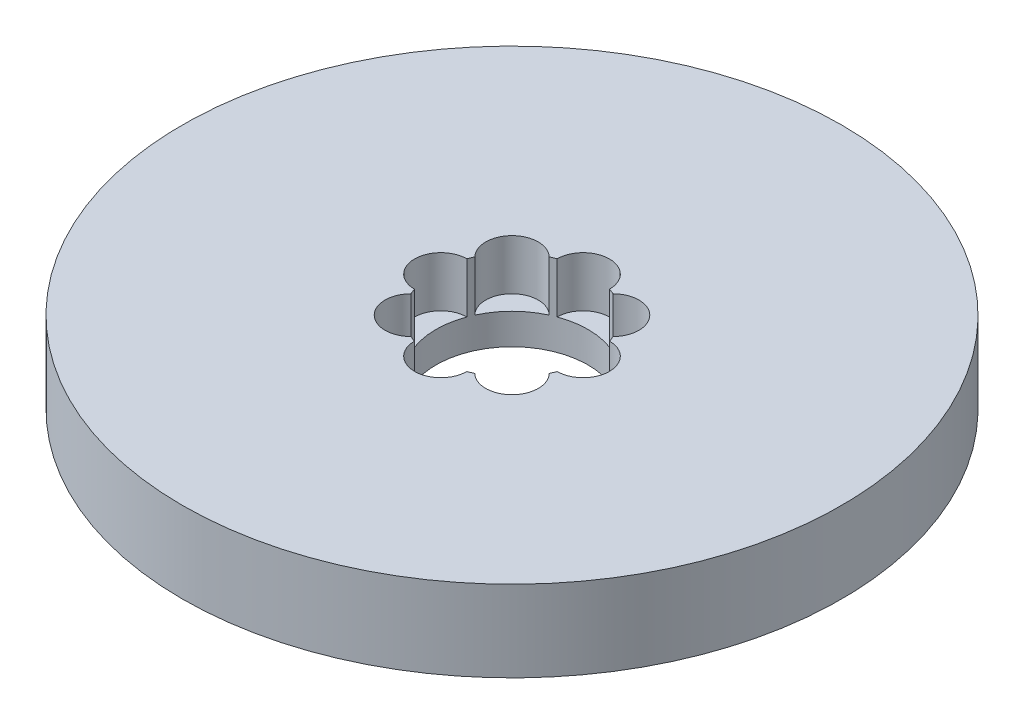
ISO-10303-21;
HEADER;
FILE_DESCRIPTION(('STEP AP214'),'2;1');
FILE_NAME('part.step','',(''),(''),'','','');
FILE_SCHEMA(('AUTOMOTIVE_DESIGN { 1 0 10303 214 1 1 1 1 }'));
ENDSEC;
DATA;
#1=APPLICATION_CONTEXT('core data for automotive mechanical design processes');
#2=APPLICATION_PROTOCOL_DEFINITION('international standard','automotive_design',2000,#1);
#3=PRODUCT_CONTEXT('',#1,'mechanical');
#4=PRODUCT('Part','Part','',(#3));
#5=PRODUCT_RELATED_PRODUCT_CATEGORY('part','',(#4));
#6=PRODUCT_DEFINITION_FORMATION('','',#4);
#7=PRODUCT_DEFINITION_CONTEXT('part definition',#1,'design');
#8=PRODUCT_DEFINITION('design','',#6,#7);
#9=PRODUCT_DEFINITION_SHAPE('','',#8);
#10=(LENGTH_UNIT() NAMED_UNIT(*) SI_UNIT(.MILLI.,.METRE.));
#11=(NAMED_UNIT(*) PLANE_ANGLE_UNIT() SI_UNIT($,.RADIAN.));
#12=(NAMED_UNIT(*) SI_UNIT($,.STERADIAN.) SOLID_ANGLE_UNIT());
#13=UNCERTAINTY_MEASURE_WITH_UNIT(LENGTH_MEASURE(1.E-05),#10,'distance_accuracy_value','');
#14=(GEOMETRIC_REPRESENTATION_CONTEXT(3) GLOBAL_UNCERTAINTY_ASSIGNED_CONTEXT((#13)) GLOBAL_UNIT_ASSIGNED_CONTEXT((#10,
#11,#12)) REPRESENTATION_CONTEXT('',''));
#15=CARTESIAN_POINT('',(0.,0.,0.));
#16=DIRECTION('',(0.,0.,1.));
#17=DIRECTION('',(1.,0.,0.));
#18=AXIS2_PLACEMENT_3D('',#15,#16,#17);
#19=CARTESIAN_POINT('',(0.,16.,0.));
#20=DIRECTION('',(0.,-1.,0.));
#21=DIRECTION('',(0.,0.,-1.));
#22=AXIS2_PLACEMENT_3D('',#19,#20,#21);
#23=CYLINDRICAL_SURFACE('',#22,65.);
#24=CARTESIAN_POINT('',(0.,16.,0.));
#25=DIRECTION('',(0.,1.,0.));
#26=DIRECTION('',(0.,0.,1.));
#27=AXIS2_PLACEMENT_3D('',#24,#25,#26);
#28=CIRCLE('',#27,65.);
#29=CARTESIAN_POINT('',(0.,16.,65.));
#30=VERTEX_POINT('',#29);
#31=EDGE_CURVE('E190',#30,#30,#28,.T.);
#32=ORIENTED_EDGE('',*,*,#31,.F.);
#33=EDGE_LOOP('',(#32));
#34=FACE_BOUND('',#33,.T.);
#35=CARTESIAN_POINT('',(0.,0.,0.));
#36=DIRECTION('',(0.,1.,0.));
#37=DIRECTION('',(0.,0.,1.));
#38=AXIS2_PLACEMENT_3D('',#35,#36,#37);
#39=CIRCLE('',#38,65.);
#40=CARTESIAN_POINT('',(0.,0.,65.));
#41=VERTEX_POINT('',#40);
#42=EDGE_CURVE('E181',#41,#41,#39,.T.);
#43=ORIENTED_EDGE('',*,*,#42,.T.);
#44=EDGE_LOOP('',(#43));
#45=FACE_BOUND('',#44,.T.);
#46=ADVANCED_FACE('F39',(#34,#45),#23,.T.);
#47=CARTESIAN_POINT('',(0.,16.,0.));
#48=DIRECTION('',(0.,1.,0.));
#49=DIRECTION('',(0.,0.,1.));
#50=AXIS2_PLACEMENT_3D('',#47,#48,#49);
#51=PLANE('',#50);
#52=CARTESIAN_POINT('',(14.0391195557123,16.,0.));
#53=DIRECTION('',(0.,1.,0.));
#54=DIRECTION('',(0.,0.,-1.));
#55=AXIS2_PLACEMENT_3D('',#52,#53,#54);
#56=CIRCLE('',#55,5.17984006948979);
#57=CARTESIAN_POINT('',(14.077312084477,16.,5.17969926503832));
#58=VERTEX_POINT('',#57);
#59=CARTESIAN_POINT('',(14.077312084477,16.,-5.17969926503832));
#60=VERTEX_POINT('',#59);
#61=EDGE_CURVE('E257',#58,#60,#56,.T.);
#62=ORIENTED_EDGE('',*,*,#61,.F.);
#63=CARTESIAN_POINT('',(0.,16.,0.));
#64=DIRECTION('',(0.,1.,0.));
#65=DIRECTION('',(0.,0.,1.));
#66=AXIS2_PLACEMENT_3D('',#63,#64,#65);
#67=CIRCLE('',#66,15.);
#68=CARTESIAN_POINT('',(13.6167633106286,16.,6.29156236099735));
#69=VERTEX_POINT('',#68);
#70=EDGE_CURVE('E336',#69,#58,#67,.T.);
#71=ORIENTED_EDGE('',*,*,#70,.F.);
#72=CARTESIAN_POINT('',(9.92715663973292,16.,9.92715663973282));
#73=DIRECTION('',(0.,1.,0.));
#74=DIRECTION('',(0.707106781186544,0.,-0.707106781186551));
#75=AXIS2_PLACEMENT_3D('',#72,#73,#74);
#76=CIRCLE('',#75,5.17984006948979);
#77=CARTESIAN_POINT('',(6.2915623609975,16.,13.6167633106285));
#78=VERTEX_POINT('',#77);
#79=EDGE_CURVE('E327',#78,#69,#76,.T.);
#80=ORIENTED_EDGE('',*,*,#79,.F.);
#81=CARTESIAN_POINT('',(5.17969926503837,16.,14.077312084477));
#82=VERTEX_POINT('',#81);
#83=EDGE_CURVE('E188',#82,#78,#67,.T.);
#84=ORIENTED_EDGE('',*,*,#83,.F.);
#85=CARTESIAN_POINT('',(0.,16.,14.0391195557123));
#86=DIRECTION('',(0.,1.,0.));
#87=DIRECTION('',(1.,0.,0.));
#88=AXIS2_PLACEMENT_3D('',#85,#86,#87);
#89=CIRCLE('',#88,5.17984006948979);
#90=CARTESIAN_POINT('',(-5.17969926503827,16.,14.077312084477));
#91=VERTEX_POINT('',#90);
#92=EDGE_CURVE('E330',#91,#82,#89,.T.);
#93=ORIENTED_EDGE('',*,*,#92,.F.);
#94=CARTESIAN_POINT('',(-6.2915623609974,16.,13.6167633106286));
#95=VERTEX_POINT('',#94);
#96=EDGE_CURVE('E172',#95,#91,#67,.T.);
#97=ORIENTED_EDGE('',*,*,#96,.F.);
#98=CARTESIAN_POINT('',(-9.92715663973285,16.,9.92715663973289));
#99=DIRECTION('',(0.,1.,0.));
#100=DIRECTION('',(0.707106781186549,0.,0.707106781186546));
#101=AXIS2_PLACEMENT_3D('',#98,#99,#100);
#102=CIRCLE('',#101,5.17984006948979);
#103=CARTESIAN_POINT('',(-13.6167633106286,16.,6.29156236099745));
#104=VERTEX_POINT('',#103);
#105=EDGE_CURVE('E152',#104,#95,#102,.T.);
#106=ORIENTED_EDGE('',*,*,#105,.F.);
#107=CARTESIAN_POINT('',(-14.077312084477,16.,5.17969926503832));
#108=VERTEX_POINT('',#107);
#109=EDGE_CURVE('E168',#108,#104,#67,.T.);
#110=ORIENTED_EDGE('',*,*,#109,.F.);
#111=CARTESIAN_POINT('',(-14.0391195557123,16.,0.));
#112=DIRECTION('',(0.,1.,0.));
#113=DIRECTION('',(0.,0.,1.));
#114=AXIS2_PLACEMENT_3D('',#111,#112,#113);
#115=CIRCLE('',#114,5.17984006948979);
#116=CARTESIAN_POINT('',(-14.077312084477,16.,-5.17969926503832));
#117=VERTEX_POINT('',#116);
#118=EDGE_CURVE('E204',#117,#108,#115,.T.);
#119=ORIENTED_EDGE('',*,*,#118,.F.);
#120=CARTESIAN_POINT('',(-13.6167633106287,16.,-6.29156236099726));
#121=VERTEX_POINT('',#120);
#122=EDGE_CURVE('E183',#121,#117,#67,.T.);
#123=ORIENTED_EDGE('',*,*,#122,.F.);
#124=CARTESIAN_POINT('',(-9.92715663973299,16.,-9.92715663973275));
#125=DIRECTION('',(0.,1.,0.));
#126=DIRECTION('',(-0.707106781186539,0.,0.707106781186556));
#127=AXIS2_PLACEMENT_3D('',#124,#125,#126);
#128=CIRCLE('',#127,5.17984006948979);
#129=CARTESIAN_POINT('',(-6.29156236099759,16.,-13.6167633106285));
#130=VERTEX_POINT('',#129);
#131=EDGE_CURVE('E347',#130,#121,#128,.T.);
#132=ORIENTED_EDGE('',*,*,#131,.F.);
#133=CARTESIAN_POINT('',(-5.17969926503847,16.,-14.0773120844769));
#134=VERTEX_POINT('',#133);
#135=EDGE_CURVE('E195',#134,#130,#67,.T.);
#136=ORIENTED_EDGE('',*,*,#135,.F.);
#137=CARTESIAN_POINT('',(-1.47051971827672E-13,16.,-14.0391195557123));
#138=DIRECTION('',(0.,1.,0.));
#139=DIRECTION('',(-1.,0.,0.));
#140=AXIS2_PLACEMENT_3D('',#137,#138,#139);
#141=CIRCLE('',#140,5.17984006948979);
#142=CARTESIAN_POINT('',(5.17969926503818,16.,-14.077312084477));
#143=VERTEX_POINT('',#142);
#144=EDGE_CURVE('E360',#143,#134,#141,.T.);
#145=ORIENTED_EDGE('',*,*,#144,.F.);
#146=CARTESIAN_POINT('',(6.29156236099731,16.,-13.6167633106286));
#147=VERTEX_POINT('',#146);
#148=EDGE_CURVE('E200',#147,#143,#67,.T.);
#149=ORIENTED_EDGE('',*,*,#148,.F.);
#150=CARTESIAN_POINT('',(9.92715663973278,16.,-9.92715663973295));
#151=DIRECTION('',(0.,1.,0.));
#152=DIRECTION('',(-0.707106781186554,0.,-0.707106781186541));
#153=AXIS2_PLACEMENT_3D('',#150,#151,#152);
#154=CIRCLE('',#153,5.17984006948979);
#155=CARTESIAN_POINT('',(13.6167633106285,16.,-6.29156236099754));
#156=VERTEX_POINT('',#155);
#157=EDGE_CURVE('E363',#156,#147,#154,.T.);
#158=ORIENTED_EDGE('',*,*,#157,.F.);
#159=EDGE_CURVE('E367',#60,#156,#67,.T.);
#160=ORIENTED_EDGE('',*,*,#159,.F.);
#161=EDGE_LOOP('',(#62,#71,#80,#84,#93,#97,#106,#110,#119,#123,#132,#136,#145,#149,#158,#160));
#162=FACE_BOUND('',#161,.T.);
#163=ORIENTED_EDGE('',*,*,#31,.T.);
#164=EDGE_LOOP('',(#163));
#165=FACE_BOUND('',#164,.T.);
#166=ADVANCED_FACE('F170',(#162,#165),#51,.T.);
#167=CARTESIAN_POINT('',(0.,0.,0.));
#168=DIRECTION('',(0.,1.,0.));
#169=DIRECTION('',(0.,0.,1.));
#170=AXIS2_PLACEMENT_3D('',#167,#168,#169);
#171=PLANE('',#170);
#172=CARTESIAN_POINT('',(0.,0.,0.));
#173=DIRECTION('',(0.,1.,0.));
#174=DIRECTION('',(0.,0.,1.));
#175=AXIS2_PLACEMENT_3D('',#172,#173,#174);
#176=CIRCLE('',#175,15.);
#177=CARTESIAN_POINT('',(0.,0.,15.));
#178=VERTEX_POINT('',#177);
#179=EDGE_CURVE('E192',#178,#178,#176,.T.);
#180=ORIENTED_EDGE('',*,*,#179,.T.);
#181=EDGE_LOOP('',(#180));
#182=FACE_BOUND('',#181,.T.);
#183=ORIENTED_EDGE('',*,*,#42,.F.);
#184=EDGE_LOOP('',(#183));
#185=FACE_BOUND('',#184,.T.);
#186=ADVANCED_FACE('F276',(#182,#185),#171,.F.);
#187=CARTESIAN_POINT('',(0.,16.,0.));
#188=DIRECTION('',(0.,-1.,0.));
#189=DIRECTION('',(0.,0.,-1.));
#190=AXIS2_PLACEMENT_3D('',#187,#188,#189);
#191=CYLINDRICAL_SURFACE('',#190,15.);
#192=DIRECTION('',(0.,1.,0.));
#193=VECTOR('',#192,1.);
#194=CARTESIAN_POINT('',(14.077312084477,11.0321519320832,5.17969926503832));
#195=LINE('',#194,#193);
#196=CARTESIAN_POINT('',(14.077312084477,6.06430386416643,5.17969926503832));
#197=VERTEX_POINT('',#196);
#198=EDGE_CURVE('E11',#197,#58,#195,.T.);
#199=ORIENTED_EDGE('',*,*,#198,.F.);
#200=CARTESIAN_POINT('',(0.,6.06430386416643,0.));
#201=DIRECTION('',(0.,1.,0.));
#202=DIRECTION('',(0.,0.,1.));
#203=AXIS2_PLACEMENT_3D('',#200,#201,#202);
#204=CIRCLE('',#203,15.);
#205=CARTESIAN_POINT('',(14.077312084477,6.06430386416643,-5.17969926503832));
#206=VERTEX_POINT('',#205);
#207=EDGE_CURVE('E254',#197,#206,#204,.T.);
#208=ORIENTED_EDGE('',*,*,#207,.T.);
#209=DIRECTION('',(0.,1.,0.));
#210=VECTOR('',#209,1.);
#211=CARTESIAN_POINT('',(14.077312084477,11.0321519320832,-5.17969926503832));
#212=LINE('',#211,#210);
#213=EDGE_CURVE('E46',#60,#206,#212,.F.);
#214=ORIENTED_EDGE('',*,*,#213,.F.);
#215=ORIENTED_EDGE('',*,*,#159,.T.);
#216=DIRECTION('',(0.,1.,0.));
#217=VECTOR('',#216,1.);
#218=CARTESIAN_POINT('',(13.6167633106285,11.0321519320832,-6.29156236099754));
#219=LINE('',#218,#217);
#220=CARTESIAN_POINT('',(13.6167633106285,6.06430386416643,-6.29156236099754));
#221=VERTEX_POINT('',#220);
#222=EDGE_CURVE('E251',#221,#156,#219,.T.);
#223=ORIENTED_EDGE('',*,*,#222,.F.);
#224=CARTESIAN_POINT('',(0.,6.06430386416643,0.));
#225=DIRECTION('',(0.,1.,0.));
#226=DIRECTION('',(0.,0.,1.));
#227=AXIS2_PLACEMENT_3D('',#224,#225,#226);
#228=CIRCLE('',#227,15.);
#229=CARTESIAN_POINT('',(6.29156236099731,6.06430386416643,-13.6167633106286));
#230=VERTEX_POINT('',#229);
#231=EDGE_CURVE('E247',#221,#230,#228,.T.);
#232=ORIENTED_EDGE('',*,*,#231,.T.);
#233=DIRECTION('',(0.,1.,0.));
#234=VECTOR('',#233,1.);
#235=CARTESIAN_POINT('',(6.29156236099731,11.0321519320832,-13.6167633106286));
#236=LINE('',#235,#234);
#237=EDGE_CURVE('E253',#147,#230,#236,.F.);
#238=ORIENTED_EDGE('',*,*,#237,.F.);
#239=ORIENTED_EDGE('',*,*,#148,.T.);
#240=DIRECTION('',(0.,1.,0.));
#241=VECTOR('',#240,1.);
#242=CARTESIAN_POINT('',(5.17969926503818,11.0321519320832,-14.077312084477));
#243=LINE('',#242,#241);
#244=CARTESIAN_POINT('',(5.17969926503818,6.06430386416643,-14.077312084477));
#245=VERTEX_POINT('',#244);
#246=EDGE_CURVE('E225',#245,#143,#243,.T.);
#247=ORIENTED_EDGE('',*,*,#246,.F.);
#248=CARTESIAN_POINT('',(0.,6.06430386416643,0.));
#249=DIRECTION('',(0.,1.,0.));
#250=DIRECTION('',(0.,0.,1.));
#251=AXIS2_PLACEMENT_3D('',#248,#249,#250);
#252=CIRCLE('',#251,15.);
#253=CARTESIAN_POINT('',(-5.17969926503847,6.06430386416643,-14.0773120844769));
#254=VERTEX_POINT('',#253);
#255=EDGE_CURVE('E159',#245,#254,#252,.T.);
#256=ORIENTED_EDGE('',*,*,#255,.T.);
#257=DIRECTION('',(0.,1.,0.));
#258=VECTOR('',#257,1.);
#259=CARTESIAN_POINT('',(-5.17969926503847,11.0321519320832,-14.0773120844769));
#260=LINE('',#259,#258);
#261=EDGE_CURVE('E218',#134,#254,#260,.F.);
#262=ORIENTED_EDGE('',*,*,#261,.F.);
#263=ORIENTED_EDGE('',*,*,#135,.T.);
#264=DIRECTION('',(0.,1.,0.));
#265=VECTOR('',#264,1.);
#266=CARTESIAN_POINT('',(-6.29156236099759,11.0321519320832,-13.6167633106285));
#267=LINE('',#266,#265);
#268=CARTESIAN_POINT('',(-6.29156236099759,6.06430386416643,-13.6167633106285));
#269=VERTEX_POINT('',#268);
#270=EDGE_CURVE('E229',#269,#130,#267,.T.);
#271=ORIENTED_EDGE('',*,*,#270,.F.);
#272=CARTESIAN_POINT('',(0.,6.06430386416643,0.));
#273=DIRECTION('',(0.,1.,0.));
#274=DIRECTION('',(0.,0.,1.));
#275=AXIS2_PLACEMENT_3D('',#272,#273,#274);
#276=CIRCLE('',#275,15.);
#277=CARTESIAN_POINT('',(-13.6167633106287,6.06430386416643,-6.29156236099726));
#278=VERTEX_POINT('',#277);
#279=EDGE_CURVE('E221',#269,#278,#276,.T.);
#280=ORIENTED_EDGE('',*,*,#279,.T.);
#281=DIRECTION('',(0.,1.,0.));
#282=VECTOR('',#281,1.);
#283=CARTESIAN_POINT('',(-13.6167633106287,11.0321519320832,-6.29156236099726));
#284=LINE('',#283,#282);
#285=EDGE_CURVE('E230',#121,#278,#284,.F.);
#286=ORIENTED_EDGE('',*,*,#285,.F.);
#287=ORIENTED_EDGE('',*,*,#122,.T.);
#288=DIRECTION('',(0.,1.,0.));
#289=VECTOR('',#288,1.);
#290=CARTESIAN_POINT('',(-14.077312084477,11.0321519320832,-5.17969926503832));
#291=LINE('',#290,#289);
#292=CARTESIAN_POINT('',(-14.077312084477,6.06430386416643,-5.17969926503832));
#293=VERTEX_POINT('',#292);
#294=EDGE_CURVE('E215',#293,#117,#291,.T.);
#295=ORIENTED_EDGE('',*,*,#294,.F.);
#296=CARTESIAN_POINT('',(0.,6.06430386416643,0.));
#297=DIRECTION('',(0.,1.,0.));
#298=DIRECTION('',(0.,0.,1.));
#299=AXIS2_PLACEMENT_3D('',#296,#297,#298);
#300=CIRCLE('',#299,15.);
#301=CARTESIAN_POINT('',(-14.077312084477,6.06430386416643,5.17969926503832));
#302=VERTEX_POINT('',#301);
#303=EDGE_CURVE('E208',#293,#302,#300,.T.);
#304=ORIENTED_EDGE('',*,*,#303,.T.);
#305=DIRECTION('',(0.,1.,0.));
#306=VECTOR('',#305,1.);
#307=CARTESIAN_POINT('',(-14.077312084477,11.0321519320832,5.17969926503832));
#308=LINE('',#307,#306);
#309=EDGE_CURVE('E185',#108,#302,#308,.F.);
#310=ORIENTED_EDGE('',*,*,#309,.F.);
#311=ORIENTED_EDGE('',*,*,#109,.T.);
#312=DIRECTION('',(0.,1.,0.));
#313=VECTOR('',#312,1.);
#314=CARTESIAN_POINT('',(-13.6167633106286,11.0321519320832,6.29156236099745));
#315=LINE('',#314,#313);
#316=CARTESIAN_POINT('',(-13.6167633106286,6.06430386416643,6.29156236099745));
#317=VERTEX_POINT('',#316);
#318=EDGE_CURVE('E147',#317,#104,#315,.T.);
#319=ORIENTED_EDGE('',*,*,#318,.F.);
#320=CARTESIAN_POINT('',(0.,6.06430386416643,0.));
#321=DIRECTION('',(0.,1.,0.));
#322=DIRECTION('',(0.,0.,1.));
#323=AXIS2_PLACEMENT_3D('',#320,#321,#322);
#324=CIRCLE('',#323,15.);
#325=CARTESIAN_POINT('',(-6.2915623609974,6.06430386416643,13.6167633106286));
#326=VERTEX_POINT('',#325);
#327=EDGE_CURVE('E212',#317,#326,#324,.T.);
#328=ORIENTED_EDGE('',*,*,#327,.T.);
#329=DIRECTION('',(0.,1.,0.));
#330=VECTOR('',#329,1.);
#331=CARTESIAN_POINT('',(-6.2915623609974,11.0321519320832,13.6167633106286));
#332=LINE('',#331,#330);
#333=EDGE_CURVE('E161',#95,#326,#332,.F.);
#334=ORIENTED_EDGE('',*,*,#333,.F.);
#335=ORIENTED_EDGE('',*,*,#96,.T.);
#336=DIRECTION('',(0.,1.,0.));
#337=VECTOR('',#336,1.);
#338=CARTESIAN_POINT('',(-5.17969926503827,11.0321519320832,14.077312084477));
#339=LINE('',#338,#337);
#340=CARTESIAN_POINT('',(-5.17969926503827,6.06430386416643,14.077312084477));
#341=VERTEX_POINT('',#340);
#342=EDGE_CURVE('E246',#341,#91,#339,.T.);
#343=ORIENTED_EDGE('',*,*,#342,.F.);
#344=CARTESIAN_POINT('',(0.,6.06430386416643,0.));
#345=DIRECTION('',(0.,1.,0.));
#346=DIRECTION('',(0.,0.,1.));
#347=AXIS2_PLACEMENT_3D('',#344,#345,#346);
#348=CIRCLE('',#347,15.);
#349=CARTESIAN_POINT('',(5.17969926503837,6.06430386416643,14.077312084477));
#350=VERTEX_POINT('',#349);
#351=EDGE_CURVE('E238',#341,#350,#348,.T.);
#352=ORIENTED_EDGE('',*,*,#351,.T.);
#353=DIRECTION('',(0.,1.,0.));
#354=VECTOR('',#353,1.);
#355=CARTESIAN_POINT('',(5.17969926503837,11.0321519320832,14.077312084477));
#356=LINE('',#355,#354);
#357=EDGE_CURVE('E242',#82,#350,#356,.F.);
#358=ORIENTED_EDGE('',*,*,#357,.F.);
#359=ORIENTED_EDGE('',*,*,#83,.T.);
#360=DIRECTION('',(0.,1.,0.));
#361=VECTOR('',#360,1.);
#362=CARTESIAN_POINT('',(6.2915623609975,11.0321519320832,13.6167633106285));
#363=LINE('',#362,#361);
#364=CARTESIAN_POINT('',(6.2915623609975,6.06430386416643,13.6167633106285));
#365=VERTEX_POINT('',#364);
#366=EDGE_CURVE('E236',#365,#78,#363,.T.);
#367=ORIENTED_EDGE('',*,*,#366,.F.);
#368=CARTESIAN_POINT('',(0.,6.06430386416643,0.));
#369=DIRECTION('',(0.,1.,0.));
#370=DIRECTION('',(0.,0.,1.));
#371=AXIS2_PLACEMENT_3D('',#368,#369,#370);
#372=CIRCLE('',#371,15.);
#373=CARTESIAN_POINT('',(13.6167633106286,6.06430386416643,6.29156236099735));
#374=VERTEX_POINT('',#373);
#375=EDGE_CURVE('E235',#365,#374,#372,.T.);
#376=ORIENTED_EDGE('',*,*,#375,.T.);
#377=DIRECTION('',(0.,1.,0.));
#378=VECTOR('',#377,1.);
#379=CARTESIAN_POINT('',(13.6167633106286,11.0321519320832,6.29156236099735));
#380=LINE('',#379,#378);
#381=EDGE_CURVE('E234',#69,#374,#380,.F.);
#382=ORIENTED_EDGE('',*,*,#381,.F.);
#383=ORIENTED_EDGE('',*,*,#70,.T.);
#384=EDGE_LOOP('',(#199,#208,#214,#215,#223,#232,#238,#239,#247,#256,#262,#263,#271,#280,#286,
#287,#295,#304,#310,#311,#319,#328,#334,#335,#343,#352,#358,#359,#367,#376,#382,#383));
#385=FACE_BOUND('',#384,.T.);
#386=ORIENTED_EDGE('',*,*,#179,.F.);
#387=EDGE_LOOP('',(#386));
#388=FACE_BOUND('',#387,.T.);
#389=ADVANCED_FACE('F177',(#385,#388),#191,.F.);
#390=CARTESIAN_POINT('',(-14.0391195557123,6.06430386416643,0.));
#391=DIRECTION('',(0.,1.,0.));
#392=DIRECTION('',(0.,0.,1.));
#393=AXIS2_PLACEMENT_3D('',#390,#391,#392);
#394=CYLINDRICAL_SURFACE('',#393,5.17984006948979);
#395=ORIENTED_EDGE('',*,*,#294,.T.);
#396=ORIENTED_EDGE('',*,*,#118,.T.);
#397=ORIENTED_EDGE('',*,*,#309,.T.);
#398=CARTESIAN_POINT('',(-14.0391195557123,6.06430386416643,0.));
#399=DIRECTION('',(0.,1.,0.));
#400=DIRECTION('',(0.,0.,1.));
#401=AXIS2_PLACEMENT_3D('',#398,#399,#400);
#402=CIRCLE('',#401,5.17984006948979);
#403=EDGE_CURVE('E203',#293,#302,#402,.T.);
#404=ORIENTED_EDGE('',*,*,#403,.F.);
#405=EDGE_LOOP('',(#395,#396,#397,#404));
#406=FACE_BOUND('',#405,.T.);
#407=ADVANCED_FACE('F288',(#406),#394,.F.);
#408=CARTESIAN_POINT('',(-14.0391195557123,6.06430386416643,0.));
#409=DIRECTION('',(0.,1.,0.));
#410=DIRECTION('',(0.,0.,1.));
#411=AXIS2_PLACEMENT_3D('',#408,#409,#410);
#412=PLANE('',#411);
#413=ORIENTED_EDGE('',*,*,#403,.T.);
#414=ORIENTED_EDGE('',*,*,#303,.F.);
#415=EDGE_LOOP('',(#413,#414));
#416=FACE_BOUND('',#415,.T.);
#417=ADVANCED_FACE('F291',(#416),#412,.T.);
#418=CARTESIAN_POINT('',(-9.92715663973285,6.06430386416643,9.92715663973289));
#419=DIRECTION('',(0.,1.,0.));
#420=DIRECTION('',(0.,0.,1.));
#421=AXIS2_PLACEMENT_3D('',#418,#419,#420);
#422=CYLINDRICAL_SURFACE('',#421,5.17984006948979);
#423=ORIENTED_EDGE('',*,*,#318,.T.);
#424=ORIENTED_EDGE('',*,*,#105,.T.);
#425=ORIENTED_EDGE('',*,*,#333,.T.);
#426=CARTESIAN_POINT('',(-9.92715663973285,6.06430386416643,9.92715663973289));
#427=DIRECTION('',(0.,1.,0.));
#428=DIRECTION('',(0.707106781186549,0.,0.707106781186546));
#429=AXIS2_PLACEMENT_3D('',#426,#427,#428);
#430=CIRCLE('',#429,5.17984006948979);
#431=EDGE_CURVE('E156',#317,#326,#430,.T.);
#432=ORIENTED_EDGE('',*,*,#431,.F.);
#433=EDGE_LOOP('',(#423,#424,#425,#432));
#434=FACE_BOUND('',#433,.T.);
#435=ADVANCED_FACE('F155',(#434),#422,.F.);
#436=CARTESIAN_POINT('',(-9.92715663973285,6.06430386416643,9.92715663973289));
#437=DIRECTION('',(0.,1.,0.));
#438=DIRECTION('',(0.707106781186549,0.,0.707106781186546));
#439=AXIS2_PLACEMENT_3D('',#436,#437,#438);
#440=PLANE('',#439);
#441=ORIENTED_EDGE('',*,*,#431,.T.);
#442=ORIENTED_EDGE('',*,*,#327,.F.);
#443=EDGE_LOOP('',(#441,#442));
#444=FACE_BOUND('',#443,.T.);
#445=ADVANCED_FACE('F299',(#444),#440,.T.);
#446=CARTESIAN_POINT('',(-1.47051971827672E-13,6.06430386416643,-14.0391195557123));
#447=DIRECTION('',(0.,1.,0.));
#448=DIRECTION('',(0.,0.,1.));
#449=AXIS2_PLACEMENT_3D('',#446,#447,#448);
#450=CYLINDRICAL_SURFACE('',#449,5.17984006948979);
#451=ORIENTED_EDGE('',*,*,#246,.T.);
#452=ORIENTED_EDGE('',*,*,#144,.T.);
#453=ORIENTED_EDGE('',*,*,#261,.T.);
#454=CARTESIAN_POINT('',(-1.47051971827672E-13,6.06430386416643,-14.0391195557123));
#455=DIRECTION('',(0.,1.,0.));
#456=DIRECTION('',(-1.,0.,0.));
#457=AXIS2_PLACEMENT_3D('',#454,#455,#456);
#458=CIRCLE('',#457,5.17984006948979);
#459=EDGE_CURVE('E356',#245,#254,#458,.T.);
#460=ORIENTED_EDGE('',*,*,#459,.F.);
#461=EDGE_LOOP('',(#451,#452,#453,#460));
#462=FACE_BOUND('',#461,.T.);
#463=ADVANCED_FACE('F302',(#462),#450,.F.);
#464=CARTESIAN_POINT('',(-1.47051971827672E-13,6.06430386416643,-14.0391195557123));
#465=DIRECTION('',(0.,1.,0.));
#466=DIRECTION('',(-1.,0.,0.));
#467=AXIS2_PLACEMENT_3D('',#464,#465,#466);
#468=PLANE('',#467);
#469=ORIENTED_EDGE('',*,*,#459,.T.);
#470=ORIENTED_EDGE('',*,*,#255,.F.);
#471=EDGE_LOOP('',(#469,#470));
#472=FACE_BOUND('',#471,.T.);
#473=ADVANCED_FACE('F377',(#472),#468,.T.);
#474=CARTESIAN_POINT('',(-9.92715663973299,6.06430386416643,-9.92715663973275));
#475=DIRECTION('',(0.,1.,0.));
#476=DIRECTION('',(0.,0.,1.));
#477=AXIS2_PLACEMENT_3D('',#474,#475,#476);
#478=CYLINDRICAL_SURFACE('',#477,5.17984006948979);
#479=ORIENTED_EDGE('',*,*,#270,.T.);
#480=ORIENTED_EDGE('',*,*,#131,.T.);
#481=ORIENTED_EDGE('',*,*,#285,.T.);
#482=CARTESIAN_POINT('',(-9.92715663973299,6.06430386416643,-9.92715663973275));
#483=DIRECTION('',(0.,1.,0.));
#484=DIRECTION('',(-0.707106781186539,0.,0.707106781186556));
#485=AXIS2_PLACEMENT_3D('',#482,#483,#484);
#486=CIRCLE('',#485,5.17984006948979);
#487=EDGE_CURVE('E349',#269,#278,#486,.T.);
#488=ORIENTED_EDGE('',*,*,#487,.F.);
#489=EDGE_LOOP('',(#479,#480,#481,#488));
#490=FACE_BOUND('',#489,.T.);
#491=ADVANCED_FACE('F385',(#490),#478,.F.);
#492=CARTESIAN_POINT('',(-9.92715663973299,6.06430386416643,-9.92715663973275));
#493=DIRECTION('',(0.,1.,0.));
#494=DIRECTION('',(-0.707106781186539,0.,0.707106781186556));
#495=AXIS2_PLACEMENT_3D('',#492,#493,#494);
#496=PLANE('',#495);
#497=ORIENTED_EDGE('',*,*,#487,.T.);
#498=ORIENTED_EDGE('',*,*,#279,.F.);
#499=EDGE_LOOP('',(#497,#498));
#500=FACE_BOUND('',#499,.T.);
#501=ADVANCED_FACE('F318',(#500),#496,.T.);
#502=CARTESIAN_POINT('',(9.92715663973292,6.06430386416643,9.92715663973282));
#503=DIRECTION('',(0.,1.,0.));
#504=DIRECTION('',(0.,0.,1.));
#505=AXIS2_PLACEMENT_3D('',#502,#503,#504);
#506=CYLINDRICAL_SURFACE('',#505,5.17984006948979);
#507=ORIENTED_EDGE('',*,*,#366,.T.);
#508=ORIENTED_EDGE('',*,*,#79,.T.);
#509=ORIENTED_EDGE('',*,*,#381,.T.);
#510=CARTESIAN_POINT('',(9.92715663973292,6.06430386416643,9.92715663973282));
#511=DIRECTION('',(0.,1.,0.));
#512=DIRECTION('',(0.707106781186544,0.,-0.707106781186551));
#513=AXIS2_PLACEMENT_3D('',#510,#511,#512);
#514=CIRCLE('',#513,5.17984006948979);
#515=EDGE_CURVE('E324',#365,#374,#514,.T.);
#516=ORIENTED_EDGE('',*,*,#515,.F.);
#517=EDGE_LOOP('',(#507,#508,#509,#516));
#518=FACE_BOUND('',#517,.T.);
#519=ADVANCED_FACE('F312',(#518),#506,.F.);
#520=CARTESIAN_POINT('',(9.92715663973292,6.06430386416643,9.92715663973282));
#521=DIRECTION('',(0.,1.,0.));
#522=DIRECTION('',(0.707106781186544,0.,-0.707106781186551));
#523=AXIS2_PLACEMENT_3D('',#520,#521,#522);
#524=PLANE('',#523);
#525=ORIENTED_EDGE('',*,*,#515,.T.);
#526=ORIENTED_EDGE('',*,*,#375,.F.);
#527=EDGE_LOOP('',(#525,#526));
#528=FACE_BOUND('',#527,.T.);
#529=ADVANCED_FACE('F310',(#528),#524,.T.);
#530=CARTESIAN_POINT('',(0.,6.06430386416643,14.0391195557123));
#531=DIRECTION('',(0.,1.,0.));
#532=DIRECTION('',(0.,0.,1.));
#533=AXIS2_PLACEMENT_3D('',#530,#531,#532);
#534=CYLINDRICAL_SURFACE('',#533,5.17984006948979);
#535=ORIENTED_EDGE('',*,*,#342,.T.);
#536=ORIENTED_EDGE('',*,*,#92,.T.);
#537=ORIENTED_EDGE('',*,*,#357,.T.);
#538=CARTESIAN_POINT('',(0.,6.06430386416643,14.0391195557123));
#539=DIRECTION('',(0.,1.,0.));
#540=DIRECTION('',(1.,0.,0.));
#541=AXIS2_PLACEMENT_3D('',#538,#539,#540);
#542=CIRCLE('',#541,5.17984006948979);
#543=EDGE_CURVE('E173',#341,#350,#542,.T.);
#544=ORIENTED_EDGE('',*,*,#543,.F.);
#545=EDGE_LOOP('',(#535,#536,#537,#544));
#546=FACE_BOUND('',#545,.T.);
#547=ADVANCED_FACE('F304',(#546),#534,.F.);
#548=CARTESIAN_POINT('',(0.,6.06430386416643,14.0391195557123));
#549=DIRECTION('',(0.,1.,0.));
#550=DIRECTION('',(1.,0.,0.));
#551=AXIS2_PLACEMENT_3D('',#548,#549,#550);
#552=PLANE('',#551);
#553=ORIENTED_EDGE('',*,*,#543,.T.);
#554=ORIENTED_EDGE('',*,*,#351,.F.);
#555=EDGE_LOOP('',(#553,#554));
#556=FACE_BOUND('',#555,.T.);
#557=ADVANCED_FACE('F306',(#556),#552,.T.);
#558=CARTESIAN_POINT('',(9.92715663973278,6.06430386416643,-9.92715663973295));
#559=DIRECTION('',(0.,1.,0.));
#560=DIRECTION('',(0.,0.,1.));
#561=AXIS2_PLACEMENT_3D('',#558,#559,#560);
#562=CYLINDRICAL_SURFACE('',#561,5.17984006948979);
#563=ORIENTED_EDGE('',*,*,#222,.T.);
#564=ORIENTED_EDGE('',*,*,#157,.T.);
#565=ORIENTED_EDGE('',*,*,#237,.T.);
#566=CARTESIAN_POINT('',(9.92715663973278,6.06430386416643,-9.92715663973295));
#567=DIRECTION('',(0.,1.,0.));
#568=DIRECTION('',(-0.707106781186554,0.,-0.707106781186541));
#569=AXIS2_PLACEMENT_3D('',#566,#567,#568);
#570=CIRCLE('',#569,5.17984006948979);
#571=EDGE_CURVE('E56',#221,#230,#570,.T.);
#572=ORIENTED_EDGE('',*,*,#571,.F.);
#573=EDGE_LOOP('',(#563,#564,#565,#572));
#574=FACE_BOUND('',#573,.T.);
#575=ADVANCED_FACE('F311',(#574),#562,.F.);
#576=CARTESIAN_POINT('',(9.92715663973278,6.06430386416643,-9.92715663973295));
#577=DIRECTION('',(0.,1.,0.));
#578=DIRECTION('',(-0.707106781186554,0.,-0.707106781186541));
#579=AXIS2_PLACEMENT_3D('',#576,#577,#578);
#580=PLANE('',#579);
#581=ORIENTED_EDGE('',*,*,#571,.T.);
#582=ORIENTED_EDGE('',*,*,#231,.F.);
#583=EDGE_LOOP('',(#581,#582));
#584=FACE_BOUND('',#583,.T.);
#585=ADVANCED_FACE('F269',(#584),#580,.T.);
#586=CARTESIAN_POINT('',(14.0391195557123,6.06430386416643,0.));
#587=DIRECTION('',(0.,1.,0.));
#588=DIRECTION('',(0.,0.,1.));
#589=AXIS2_PLACEMENT_3D('',#586,#587,#588);
#590=CYLINDRICAL_SURFACE('',#589,5.17984006948979);
#591=ORIENTED_EDGE('',*,*,#198,.T.);
#592=ORIENTED_EDGE('',*,*,#61,.T.);
#593=ORIENTED_EDGE('',*,*,#213,.T.);
#594=CARTESIAN_POINT('',(14.0391195557123,6.06430386416643,0.));
#595=DIRECTION('',(0.,1.,0.));
#596=DIRECTION('',(0.,0.,-1.));
#597=AXIS2_PLACEMENT_3D('',#594,#595,#596);
#598=CIRCLE('',#597,5.17984006948979);
#599=EDGE_CURVE('E55',#197,#206,#598,.T.);
#600=ORIENTED_EDGE('',*,*,#599,.F.);
#601=EDGE_LOOP('',(#591,#592,#593,#600));
#602=FACE_BOUND('',#601,.T.);
#603=ADVANCED_FACE('F259',(#602),#590,.F.);
#604=CARTESIAN_POINT('',(14.0391195557123,6.06430386416643,0.));
#605=DIRECTION('',(0.,1.,0.));
#606=DIRECTION('',(0.,0.,-1.));
#607=AXIS2_PLACEMENT_3D('',#604,#605,#606);
#608=PLANE('',#607);
#609=ORIENTED_EDGE('',*,*,#599,.T.);
#610=ORIENTED_EDGE('',*,*,#207,.F.);
#611=EDGE_LOOP('',(#609,#610));
#612=FACE_BOUND('',#611,.T.);
#613=ADVANCED_FACE('F262',(#612),#608,.T.);
#614=CLOSED_SHELL('',(#46,#166,#186,#389,#407,#417,#435,#445,#463,#473,#491,#501,#519,#529,#547,
#557,#575,#585,#603,#613));
#615=MANIFOLD_SOLID_BREP('B2',#614);
#616=ADVANCED_BREP_SHAPE_REPRESENTATION('',(#18,#615),#14);
#617=SHAPE_DEFINITION_REPRESENTATION(#9,#616);
ENDSEC;
END-ISO-10303-21;
